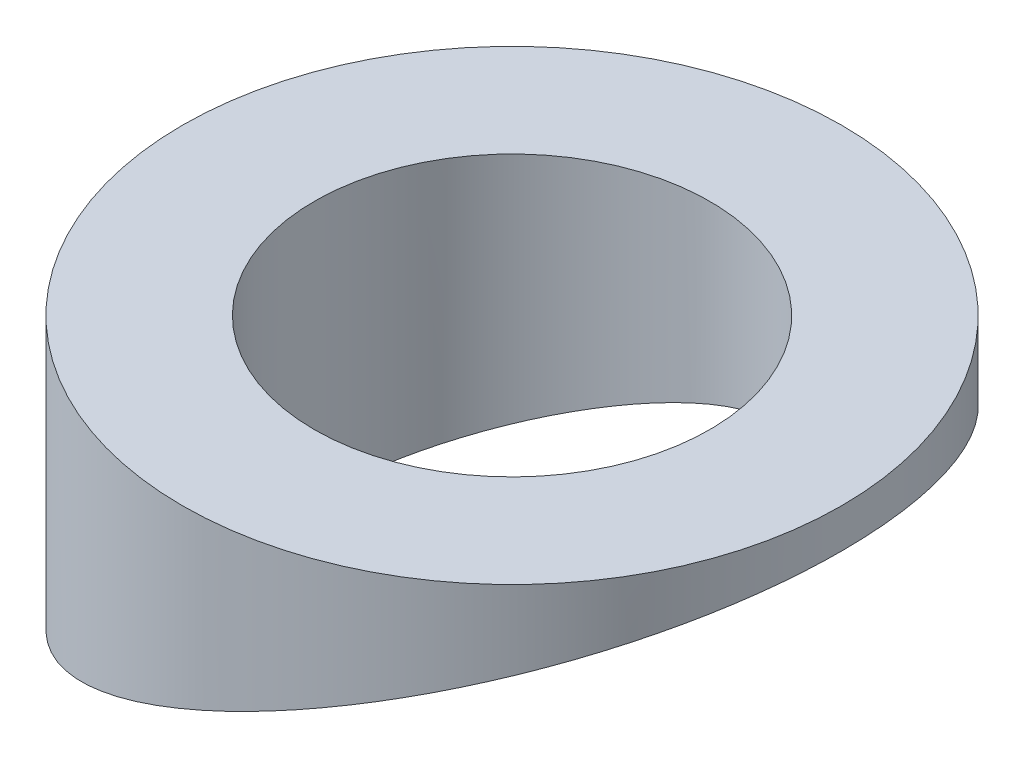
ISO-10303-21;
HEADER;
FILE_DESCRIPTION(('STEP AP214'),'2;1');
FILE_NAME('part.step','',(''),(''),'','','');
FILE_SCHEMA(('AUTOMOTIVE_DESIGN { 1 0 10303 214 1 1 1 1 }'));
ENDSEC;
DATA;
#1=APPLICATION_CONTEXT('core data for automotive mechanical design processes');
#2=APPLICATION_PROTOCOL_DEFINITION('international standard','automotive_design',2000,#1);
#3=PRODUCT_CONTEXT('',#1,'mechanical');
#4=PRODUCT('Part','Part','',(#3));
#5=PRODUCT_RELATED_PRODUCT_CATEGORY('part','',(#4));
#6=PRODUCT_DEFINITION_FORMATION('','',#4);
#7=PRODUCT_DEFINITION_CONTEXT('part definition',#1,'design');
#8=PRODUCT_DEFINITION('design','',#6,#7);
#9=PRODUCT_DEFINITION_SHAPE('','',#8);
#10=(LENGTH_UNIT() NAMED_UNIT(*) SI_UNIT(.MILLI.,.METRE.));
#11=(NAMED_UNIT(*) PLANE_ANGLE_UNIT() SI_UNIT($,.RADIAN.));
#12=(NAMED_UNIT(*) SI_UNIT($,.STERADIAN.) SOLID_ANGLE_UNIT());
#13=UNCERTAINTY_MEASURE_WITH_UNIT(LENGTH_MEASURE(1.E-05),#10,'distance_accuracy_value','');
#14=(GEOMETRIC_REPRESENTATION_CONTEXT(3) GLOBAL_UNCERTAINTY_ASSIGNED_CONTEXT((#13)) GLOBAL_UNIT_ASSIGNED_CONTEXT((#10,
#11,#12)) REPRESENTATION_CONTEXT('',''));
#15=CARTESIAN_POINT('',(0.,0.,0.));
#16=DIRECTION('',(0.,0.,1.));
#17=DIRECTION('',(1.,0.,0.));
#18=AXIS2_PLACEMENT_3D('',#15,#16,#17);
#19=CARTESIAN_POINT('',(0.,20.,0.));
#20=DIRECTION('',(0.,-1.,0.));
#21=DIRECTION('',(0.,0.,-1.));
#22=AXIS2_PLACEMENT_3D('',#19,#20,#21);
#23=CYLINDRICAL_SURFACE('',#22,15.);
#24=CARTESIAN_POINT('',(0.,20.,0.));
#25=DIRECTION('',(0.,1.,0.));
#26=DIRECTION('',(0.,0.,1.));
#27=AXIS2_PLACEMENT_3D('',#24,#25,#26);
#28=CIRCLE('',#27,15.);
#29=CARTESIAN_POINT('',(0.,20.,15.));
#30=VERTEX_POINT('',#29);
#31=EDGE_CURVE('E52',#30,#30,#28,.T.);
#32=ORIENTED_EDGE('',*,*,#31,.F.);
#33=EDGE_LOOP('',(#32));
#34=FACE_BOUND('',#33,.T.);
#35=CARTESIAN_POINT('',(0.,12.,0.));
#36=DIRECTION('',(-0.382683432365091,0.923879532511287,0.));
#37=DIRECTION('',(-0.923879532511287,-0.382683432365091,0.));
#38=AXIS2_PLACEMENT_3D('',#35,#36,#37);
#39=ELLIPSE('',#38,16.2358830043859,15.);
#40=CARTESIAN_POINT('',(-15.,5.78679656440356,0.));
#41=VERTEX_POINT('',#40);
#42=EDGE_CURVE('E12',#41,#41,#39,.T.);
#43=ORIENTED_EDGE('',*,*,#42,.T.);
#44=EDGE_LOOP('',(#43));
#45=FACE_BOUND('',#44,.T.);
#46=ADVANCED_FACE('F45',(#34,#45),#23,.T.);
#47=CARTESIAN_POINT('',(0.,20.,0.));
#48=DIRECTION('',(0.,1.,0.));
#49=DIRECTION('',(0.,0.,1.));
#50=AXIS2_PLACEMENT_3D('',#47,#48,#49);
#51=PLANE('',#50);
#52=CARTESIAN_POINT('',(0.,20.,0.));
#53=DIRECTION('',(0.,1.,0.));
#54=DIRECTION('',(0.,0.,1.));
#55=AXIS2_PLACEMENT_3D('',#52,#53,#54);
#56=CIRCLE('',#55,9.);
#57=CARTESIAN_POINT('',(0.,20.,9.));
#58=VERTEX_POINT('',#57);
#59=EDGE_CURVE('E58',#58,#58,#56,.T.);
#60=ORIENTED_EDGE('',*,*,#59,.F.);
#61=EDGE_LOOP('',(#60));
#62=FACE_BOUND('',#61,.T.);
#63=ORIENTED_EDGE('',*,*,#31,.T.);
#64=EDGE_LOOP('',(#63));
#65=FACE_BOUND('',#64,.T.);
#66=ADVANCED_FACE('F74',(#62,#65),#51,.T.);
#67=CARTESIAN_POINT('',(-15.,5.78679656440356,-16.5));
#68=DIRECTION('',(-0.382683432365091,0.923879532511287,0.));
#69=DIRECTION('',(-0.923879532511287,-0.382683432365091,0.));
#70=AXIS2_PLACEMENT_3D('',#67,#68,#69);
#71=PLANE('',#70);
#72=CARTESIAN_POINT('',(0.,12.,0.));
#73=DIRECTION('',(-0.382683432365091,0.923879532511287,0.));
#74=DIRECTION('',(0.923879532511287,0.382683432365091,0.));
#75=AXIS2_PLACEMENT_3D('',#72,#73,#74);
#76=ELLIPSE('',#75,9.74152980263155,9.);
#77=CARTESIAN_POINT('',(9.,15.7279220613579,0.));
#78=VERTEX_POINT('',#77);
#79=EDGE_CURVE('E48',#78,#78,#76,.T.);
#80=ORIENTED_EDGE('',*,*,#79,.T.);
#81=EDGE_LOOP('',(#80));
#82=FACE_BOUND('',#81,.T.);
#83=ORIENTED_EDGE('',*,*,#42,.F.);
#84=EDGE_LOOP('',(#83));
#85=FACE_BOUND('',#84,.T.);
#86=ADVANCED_FACE('F65',(#82,#85),#71,.F.);
#87=CARTESIAN_POINT('',(0.,-4.50000000000001,0.));
#88=DIRECTION('',(0.,1.,0.));
#89=DIRECTION('',(0.,0.,1.));
#90=AXIS2_PLACEMENT_3D('',#87,#88,#89);
#91=CYLINDRICAL_SURFACE('',#90,9.);
#92=ORIENTED_EDGE('',*,*,#59,.T.);
#93=EDGE_LOOP('',(#92));
#94=FACE_BOUND('',#93,.T.);
#95=ORIENTED_EDGE('',*,*,#79,.F.);
#96=EDGE_LOOP('',(#95));
#97=FACE_BOUND('',#96,.T.);
#98=ADVANCED_FACE('F68',(#94,#97),#91,.F.);
#99=CLOSED_SHELL('',(#46,#66,#86,#98));
#100=MANIFOLD_SOLID_BREP('B2',#99);
#101=ADVANCED_BREP_SHAPE_REPRESENTATION('',(#18,#100),#14);
#102=SHAPE_DEFINITION_REPRESENTATION(#9,#101);
ENDSEC;
END-ISO-10303-21;
